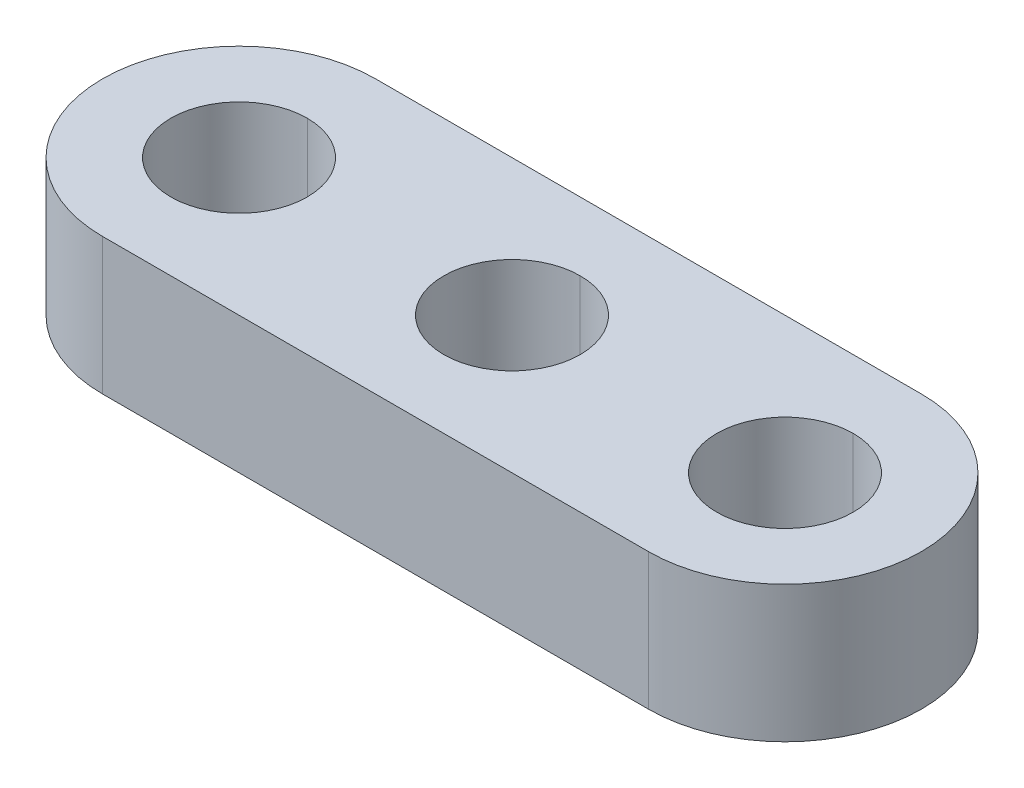
ISO-10303-21;
HEADER;
FILE_DESCRIPTION(('STEP AP214'),'2;1');
FILE_NAME('part.step','',(''),(''),'','','');
FILE_SCHEMA(('AUTOMOTIVE_DESIGN { 1 0 10303 214 1 1 1 1 }'));
ENDSEC;
DATA;
#1=APPLICATION_CONTEXT('core data for automotive mechanical design processes');
#2=APPLICATION_PROTOCOL_DEFINITION('international standard','automotive_design',2000,#1);
#3=PRODUCT_CONTEXT('',#1,'mechanical');
#4=PRODUCT('Part','Part','',(#3));
#5=PRODUCT_RELATED_PRODUCT_CATEGORY('part','',(#4));
#6=PRODUCT_DEFINITION_FORMATION('','',#4);
#7=PRODUCT_DEFINITION_CONTEXT('part definition',#1,'design');
#8=PRODUCT_DEFINITION('design','',#6,#7);
#9=PRODUCT_DEFINITION_SHAPE('','',#8);
#10=(LENGTH_UNIT() NAMED_UNIT(*) SI_UNIT(.MILLI.,.METRE.));
#11=(NAMED_UNIT(*) PLANE_ANGLE_UNIT() SI_UNIT($,.RADIAN.));
#12=(NAMED_UNIT(*) SI_UNIT($,.STERADIAN.) SOLID_ANGLE_UNIT());
#13=UNCERTAINTY_MEASURE_WITH_UNIT(LENGTH_MEASURE(1.E-05),#10,'distance_accuracy_value','');
#14=(GEOMETRIC_REPRESENTATION_CONTEXT(3) GLOBAL_UNCERTAINTY_ASSIGNED_CONTEXT((#13)) GLOBAL_UNIT_ASSIGNED_CONTEXT((#10,
#11,#12)) REPRESENTATION_CONTEXT('',''));
#15=CARTESIAN_POINT('',(0.,0.,0.));
#16=DIRECTION('',(0.,0.,1.));
#17=DIRECTION('',(1.,0.,0.));
#18=AXIS2_PLACEMENT_3D('',#15,#16,#17);
#19=CARTESIAN_POINT('',(8.,4.,0.));
#20=DIRECTION('',(0.,1.,0.));
#21=DIRECTION('',(0.,0.,1.));
#22=AXIS2_PLACEMENT_3D('',#19,#20,#21);
#23=CYLINDRICAL_SURFACE('',#22,2.);
#24=DIRECTION('',(0.,1.,0.));
#25=VECTOR('',#24,1.);
#26=CARTESIAN_POINT('',(8.,4.,-2.));
#27=LINE('',#26,#25);
#28=CARTESIAN_POINT('',(8.,0.,-2.));
#29=VERTEX_POINT('',#28);
#30=CARTESIAN_POINT('',(8.,4.,-2.));
#31=VERTEX_POINT('',#30);
#32=EDGE_CURVE('E17',#29,#31,#27,.T.);
#33=ORIENTED_EDGE('',*,*,#32,.F.);
#34=CARTESIAN_POINT('',(8.,0.,0.));
#35=DIRECTION('',(0.,1.,0.));
#36=DIRECTION('',(0.,0.,1.));
#37=AXIS2_PLACEMENT_3D('',#34,#35,#36);
#38=CIRCLE('',#37,2.);
#39=CARTESIAN_POINT('',(8.,0.,2.));
#40=VERTEX_POINT('',#39);
#41=EDGE_CURVE('E180',#40,#29,#38,.T.);
#42=ORIENTED_EDGE('',*,*,#41,.F.);
#43=DIRECTION('',(0.,1.,0.));
#44=VECTOR('',#43,1.);
#45=CARTESIAN_POINT('',(8.,4.,2.));
#46=LINE('',#45,#44);
#47=CARTESIAN_POINT('',(8.,4.,2.));
#48=VERTEX_POINT('',#47);
#49=EDGE_CURVE('E182',#40,#48,#46,.T.);
#50=ORIENTED_EDGE('',*,*,#49,.T.);
#51=CARTESIAN_POINT('',(8.,4.,0.));
#52=DIRECTION('',(0.,1.,0.));
#53=DIRECTION('',(0.,0.,1.));
#54=AXIS2_PLACEMENT_3D('',#51,#52,#53);
#55=CIRCLE('',#54,2.);
#56=EDGE_CURVE('E106',#48,#31,#55,.T.);
#57=ORIENTED_EDGE('',*,*,#56,.T.);
#58=EDGE_LOOP('',(#33,#42,#50,#57));
#59=FACE_BOUND('',#58,.T.);
#60=ADVANCED_FACE('F14',(#59),#23,.F.);
#61=CARTESIAN_POINT('',(0.,4.,0.));
#62=DIRECTION('',(0.,1.,0.));
#63=DIRECTION('',(0.,0.,1.));
#64=AXIS2_PLACEMENT_3D('',#61,#62,#63);
#65=CYLINDRICAL_SURFACE('',#64,2.);
#66=DIRECTION('',(0.,1.,0.));
#67=VECTOR('',#66,1.);
#68=CARTESIAN_POINT('',(0.,4.,-2.));
#69=LINE('',#68,#67);
#70=CARTESIAN_POINT('',(0.,0.,-2.));
#71=VERTEX_POINT('',#70);
#72=CARTESIAN_POINT('',(0.,4.,-2.));
#73=VERTEX_POINT('',#72);
#74=EDGE_CURVE('E118',#71,#73,#69,.T.);
#75=ORIENTED_EDGE('',*,*,#74,.F.);
#76=CARTESIAN_POINT('',(0.,0.,0.));
#77=DIRECTION('',(0.,1.,0.));
#78=DIRECTION('',(0.,0.,1.));
#79=AXIS2_PLACEMENT_3D('',#76,#77,#78);
#80=CIRCLE('',#79,2.);
#81=CARTESIAN_POINT('',(0.,0.,2.));
#82=VERTEX_POINT('',#81);
#83=EDGE_CURVE('E24',#82,#71,#80,.T.);
#84=ORIENTED_EDGE('',*,*,#83,.F.);
#85=DIRECTION('',(0.,1.,0.));
#86=VECTOR('',#85,1.);
#87=CARTESIAN_POINT('',(0.,4.,2.));
#88=LINE('',#87,#86);
#89=CARTESIAN_POINT('',(0.,4.,2.));
#90=VERTEX_POINT('',#89);
#91=EDGE_CURVE('E109',#82,#90,#88,.T.);
#92=ORIENTED_EDGE('',*,*,#91,.T.);
#93=CARTESIAN_POINT('',(0.,4.,0.));
#94=DIRECTION('',(0.,1.,0.));
#95=DIRECTION('',(0.,0.,1.));
#96=AXIS2_PLACEMENT_3D('',#93,#94,#95);
#97=CIRCLE('',#96,2.);
#98=EDGE_CURVE('E95',#90,#73,#97,.T.);
#99=ORIENTED_EDGE('',*,*,#98,.T.);
#100=EDGE_LOOP('',(#75,#84,#92,#99));
#101=FACE_BOUND('',#100,.T.);
#102=ADVANCED_FACE('F110',(#101),#65,.F.);
#103=CARTESIAN_POINT('',(-8.,4.,0.));
#104=DIRECTION('',(0.,1.,0.));
#105=DIRECTION('',(0.,0.,1.));
#106=AXIS2_PLACEMENT_3D('',#103,#104,#105);
#107=CYLINDRICAL_SURFACE('',#106,2.);
#108=DIRECTION('',(0.,1.,0.));
#109=VECTOR('',#108,1.);
#110=CARTESIAN_POINT('',(-8.,4.,-2.));
#111=LINE('',#110,#109);
#112=CARTESIAN_POINT('',(-8.,0.,-2.));
#113=VERTEX_POINT('',#112);
#114=CARTESIAN_POINT('',(-8.,4.,-2.));
#115=VERTEX_POINT('',#114);
#116=EDGE_CURVE('E140',#113,#115,#111,.T.);
#117=ORIENTED_EDGE('',*,*,#116,.F.);
#118=CARTESIAN_POINT('',(-8.,0.,0.));
#119=DIRECTION('',(0.,1.,0.));
#120=DIRECTION('',(0.,0.,1.));
#121=AXIS2_PLACEMENT_3D('',#118,#119,#120);
#122=CIRCLE('',#121,2.);
#123=CARTESIAN_POINT('',(-8.,0.,2.));
#124=VERTEX_POINT('',#123);
#125=EDGE_CURVE('E9',#124,#113,#122,.T.);
#126=ORIENTED_EDGE('',*,*,#125,.F.);
#127=DIRECTION('',(0.,1.,0.));
#128=VECTOR('',#127,1.);
#129=CARTESIAN_POINT('',(-8.,4.,2.));
#130=LINE('',#129,#128);
#131=CARTESIAN_POINT('',(-8.,4.,2.));
#132=VERTEX_POINT('',#131);
#133=EDGE_CURVE('E129',#124,#132,#130,.T.);
#134=ORIENTED_EDGE('',*,*,#133,.T.);
#135=CARTESIAN_POINT('',(-8.,4.,0.));
#136=DIRECTION('',(0.,1.,0.));
#137=DIRECTION('',(0.,0.,1.));
#138=AXIS2_PLACEMENT_3D('',#135,#136,#137);
#139=CIRCLE('',#138,2.);
#140=EDGE_CURVE('E105',#132,#115,#139,.T.);
#141=ORIENTED_EDGE('',*,*,#140,.T.);
#142=EDGE_LOOP('',(#117,#126,#134,#141));
#143=FACE_BOUND('',#142,.T.);
#144=ADVANCED_FACE('F263',(#143),#107,.F.);
#145=CARTESIAN_POINT('',(-8.,0.,0.));
#146=DIRECTION('',(0.,1.,0.));
#147=DIRECTION('',(1.,0.,0.));
#148=AXIS2_PLACEMENT_3D('',#145,#146,#147);
#149=PLANE('',#148);
#150=ORIENTED_EDGE('',*,*,#125,.T.);
#151=CARTESIAN_POINT('',(-8.,0.,0.));
#152=DIRECTION('',(0.,1.,0.));
#153=DIRECTION('',(0.,0.,1.));
#154=AXIS2_PLACEMENT_3D('',#151,#152,#153);
#155=CIRCLE('',#154,2.);
#156=EDGE_CURVE('E115',#113,#124,#155,.T.);
#157=ORIENTED_EDGE('',*,*,#156,.T.);
#158=EDGE_LOOP('',(#150,#157));
#159=FACE_BOUND('',#158,.T.);
#160=ORIENTED_EDGE('',*,*,#83,.T.);
#161=CARTESIAN_POINT('',(0.,0.,0.));
#162=DIRECTION('',(0.,1.,0.));
#163=DIRECTION('',(0.,0.,1.));
#164=AXIS2_PLACEMENT_3D('',#161,#162,#163);
#165=CIRCLE('',#164,2.);
#166=EDGE_CURVE('E125',#71,#82,#165,.T.);
#167=ORIENTED_EDGE('',*,*,#166,.T.);
#168=EDGE_LOOP('',(#160,#167));
#169=FACE_BOUND('',#168,.T.);
#170=ORIENTED_EDGE('',*,*,#41,.T.);
#171=CARTESIAN_POINT('',(8.,0.,0.));
#172=DIRECTION('',(0.,1.,0.));
#173=DIRECTION('',(0.,0.,1.));
#174=AXIS2_PLACEMENT_3D('',#171,#172,#173);
#175=CIRCLE('',#174,2.);
#176=EDGE_CURVE('E218',#29,#40,#175,.T.);
#177=ORIENTED_EDGE('',*,*,#176,.T.);
#178=EDGE_LOOP('',(#170,#177));
#179=FACE_BOUND('',#178,.T.);
#180=CARTESIAN_POINT('',(-8.,0.,0.));
#181=DIRECTION('',(0.,1.,0.));
#182=DIRECTION('',(0.,0.,1.));
#183=AXIS2_PLACEMENT_3D('',#180,#181,#182);
#184=CIRCLE('',#183,4.);
#185=CARTESIAN_POINT('',(-8.,0.,-4.));
#186=VERTEX_POINT('',#185);
#187=CARTESIAN_POINT('',(-8.,0.,4.));
#188=VERTEX_POINT('',#187);
#189=EDGE_CURVE('E131',#186,#188,#184,.T.);
#190=ORIENTED_EDGE('',*,*,#189,.F.);
#191=DIRECTION('',(-1.,0.,0.));
#192=VECTOR('',#191,1.);
#193=CARTESIAN_POINT('',(-8.,0.,-4.));
#194=LINE('',#193,#192);
#195=CARTESIAN_POINT('',(8.,0.,-4.));
#196=VERTEX_POINT('',#195);
#197=EDGE_CURVE('E158',#196,#186,#194,.T.);
#198=ORIENTED_EDGE('',*,*,#197,.F.);
#199=CARTESIAN_POINT('',(8.,0.,0.));
#200=DIRECTION('',(0.,1.,0.));
#201=DIRECTION('',(0.,0.,1.));
#202=AXIS2_PLACEMENT_3D('',#199,#200,#201);
#203=CIRCLE('',#202,4.);
#204=CARTESIAN_POINT('',(8.,0.,4.));
#205=VERTEX_POINT('',#204);
#206=EDGE_CURVE('E150',#205,#196,#203,.T.);
#207=ORIENTED_EDGE('',*,*,#206,.F.);
#208=DIRECTION('',(1.,0.,0.));
#209=VECTOR('',#208,1.);
#210=CARTESIAN_POINT('',(-8.,0.,4.));
#211=LINE('',#210,#209);
#212=EDGE_CURVE('E137',#188,#205,#211,.T.);
#213=ORIENTED_EDGE('',*,*,#212,.F.);
#214=EDGE_LOOP('',(#190,#198,#207,#213));
#215=FACE_BOUND('',#214,.T.);
#216=ADVANCED_FACE('F236',(#159,#169,#179,#215),#149,.F.);
#217=CARTESIAN_POINT('',(-8.,4.,0.));
#218=DIRECTION('',(0.,1.,0.));
#219=DIRECTION('',(1.,0.,0.));
#220=AXIS2_PLACEMENT_3D('',#217,#218,#219);
#221=PLANE('',#220);
#222=ORIENTED_EDGE('',*,*,#140,.F.);
#223=CARTESIAN_POINT('',(-8.,4.,0.));
#224=DIRECTION('',(0.,1.,0.));
#225=DIRECTION('',(0.,0.,1.));
#226=AXIS2_PLACEMENT_3D('',#223,#224,#225);
#227=CIRCLE('',#226,2.);
#228=EDGE_CURVE('E132',#115,#132,#227,.T.);
#229=ORIENTED_EDGE('',*,*,#228,.F.);
#230=EDGE_LOOP('',(#222,#229));
#231=FACE_BOUND('',#230,.T.);
#232=ORIENTED_EDGE('',*,*,#98,.F.);
#233=CARTESIAN_POINT('',(0.,4.,0.));
#234=DIRECTION('',(0.,1.,0.));
#235=DIRECTION('',(0.,0.,1.));
#236=AXIS2_PLACEMENT_3D('',#233,#234,#235);
#237=CIRCLE('',#236,2.);
#238=EDGE_CURVE('E100',#73,#90,#237,.T.);
#239=ORIENTED_EDGE('',*,*,#238,.F.);
#240=EDGE_LOOP('',(#232,#239));
#241=FACE_BOUND('',#240,.T.);
#242=ORIENTED_EDGE('',*,*,#56,.F.);
#243=CARTESIAN_POINT('',(8.,4.,0.));
#244=DIRECTION('',(0.,1.,0.));
#245=DIRECTION('',(0.,0.,1.));
#246=AXIS2_PLACEMENT_3D('',#243,#244,#245);
#247=CIRCLE('',#246,2.);
#248=EDGE_CURVE('E193',#31,#48,#247,.T.);
#249=ORIENTED_EDGE('',*,*,#248,.F.);
#250=EDGE_LOOP('',(#242,#249));
#251=FACE_BOUND('',#250,.T.);
#252=CARTESIAN_POINT('',(-8.,4.,0.));
#253=DIRECTION('',(0.,1.,0.));
#254=DIRECTION('',(0.,0.,1.));
#255=AXIS2_PLACEMENT_3D('',#252,#253,#254);
#256=CIRCLE('',#255,4.);
#257=CARTESIAN_POINT('',(-8.,4.,-4.));
#258=VERTEX_POINT('',#257);
#259=CARTESIAN_POINT('',(-8.,4.,4.));
#260=VERTEX_POINT('',#259);
#261=EDGE_CURVE('E138',#258,#260,#256,.T.);
#262=ORIENTED_EDGE('',*,*,#261,.T.);
#263=DIRECTION('',(1.,0.,0.));
#264=VECTOR('',#263,1.);
#265=CARTESIAN_POINT('',(-8.,4.,4.));
#266=LINE('',#265,#264);
#267=CARTESIAN_POINT('',(8.,4.,4.));
#268=VERTEX_POINT('',#267);
#269=EDGE_CURVE('E161',#260,#268,#266,.T.);
#270=ORIENTED_EDGE('',*,*,#269,.T.);
#271=CARTESIAN_POINT('',(8.,4.,0.));
#272=DIRECTION('',(0.,1.,0.));
#273=DIRECTION('',(0.,0.,1.));
#274=AXIS2_PLACEMENT_3D('',#271,#272,#273);
#275=CIRCLE('',#274,4.);
#276=CARTESIAN_POINT('',(8.,4.,-4.));
#277=VERTEX_POINT('',#276);
#278=EDGE_CURVE('E149',#268,#277,#275,.T.);
#279=ORIENTED_EDGE('',*,*,#278,.T.);
#280=DIRECTION('',(-1.,0.,0.));
#281=VECTOR('',#280,1.);
#282=CARTESIAN_POINT('',(-8.,4.,-4.));
#283=LINE('',#282,#281);
#284=EDGE_CURVE('E39',#277,#258,#283,.T.);
#285=ORIENTED_EDGE('',*,*,#284,.T.);
#286=EDGE_LOOP('',(#262,#270,#279,#285));
#287=FACE_BOUND('',#286,.T.);
#288=ADVANCED_FACE('F97',(#231,#241,#251,#287),#221,.T.);
#289=CARTESIAN_POINT('',(-8.,4.,-4.));
#290=DIRECTION('',(0.,0.,1.));
#291=DIRECTION('',(1.,0.,0.));
#292=AXIS2_PLACEMENT_3D('',#289,#290,#291);
#293=PLANE('',#292);
#294=ORIENTED_EDGE('',*,*,#197,.T.);
#295=DIRECTION('',(0.,-1.,0.));
#296=VECTOR('',#295,1.);
#297=CARTESIAN_POINT('',(-8.,4.,-4.));
#298=LINE('',#297,#296);
#299=EDGE_CURVE('E134',#258,#186,#298,.T.);
#300=ORIENTED_EDGE('',*,*,#299,.F.);
#301=ORIENTED_EDGE('',*,*,#284,.F.);
#302=DIRECTION('',(0.,-1.,0.));
#303=VECTOR('',#302,1.);
#304=CARTESIAN_POINT('',(8.,4.,-4.));
#305=LINE('',#304,#303);
#306=EDGE_CURVE('E147',#277,#196,#305,.T.);
#307=ORIENTED_EDGE('',*,*,#306,.T.);
#308=EDGE_LOOP('',(#294,#300,#301,#307));
#309=FACE_BOUND('',#308,.T.);
#310=ADVANCED_FACE('F271',(#309),#293,.F.);
#311=CARTESIAN_POINT('',(8.,4.,0.));
#312=DIRECTION('',(0.,-1.,0.));
#313=DIRECTION('',(0.,0.,-1.));
#314=AXIS2_PLACEMENT_3D('',#311,#312,#313);
#315=CYLINDRICAL_SURFACE('',#314,4.);
#316=ORIENTED_EDGE('',*,*,#206,.T.);
#317=ORIENTED_EDGE('',*,*,#306,.F.);
#318=ORIENTED_EDGE('',*,*,#278,.F.);
#319=DIRECTION('',(0.,-1.,0.));
#320=VECTOR('',#319,1.);
#321=CARTESIAN_POINT('',(8.,4.,4.));
#322=LINE('',#321,#320);
#323=EDGE_CURVE('E171',#268,#205,#322,.T.);
#324=ORIENTED_EDGE('',*,*,#323,.T.);
#325=EDGE_LOOP('',(#316,#317,#318,#324));
#326=FACE_BOUND('',#325,.T.);
#327=ADVANCED_FACE('F227',(#326),#315,.T.);
#328=CARTESIAN_POINT('',(-8.,4.,4.));
#329=DIRECTION('',(0.,0.,-1.));
#330=DIRECTION('',(0.,-1.,0.));
#331=AXIS2_PLACEMENT_3D('',#328,#329,#330);
#332=PLANE('',#331);
#333=ORIENTED_EDGE('',*,*,#212,.T.);
#334=ORIENTED_EDGE('',*,*,#323,.F.);
#335=ORIENTED_EDGE('',*,*,#269,.F.);
#336=DIRECTION('',(0.,-1.,0.));
#337=VECTOR('',#336,1.);
#338=CARTESIAN_POINT('',(-8.,4.,4.));
#339=LINE('',#338,#337);
#340=EDGE_CURVE('E146',#260,#188,#339,.T.);
#341=ORIENTED_EDGE('',*,*,#340,.T.);
#342=EDGE_LOOP('',(#333,#334,#335,#341));
#343=FACE_BOUND('',#342,.T.);
#344=ADVANCED_FACE('F232',(#343),#332,.F.);
#345=CARTESIAN_POINT('',(-8.,4.,0.));
#346=DIRECTION('',(0.,-1.,0.));
#347=DIRECTION('',(0.,0.,-1.));
#348=AXIS2_PLACEMENT_3D('',#345,#346,#347);
#349=CYLINDRICAL_SURFACE('',#348,4.);
#350=ORIENTED_EDGE('',*,*,#189,.T.);
#351=ORIENTED_EDGE('',*,*,#340,.F.);
#352=ORIENTED_EDGE('',*,*,#261,.F.);
#353=ORIENTED_EDGE('',*,*,#299,.T.);
#354=EDGE_LOOP('',(#350,#351,#352,#353));
#355=FACE_BOUND('',#354,.T.);
#356=ADVANCED_FACE('F287',(#355),#349,.T.);
#357=CARTESIAN_POINT('',(-8.,4.,0.));
#358=DIRECTION('',(0.,1.,0.));
#359=DIRECTION('',(0.,0.,1.));
#360=AXIS2_PLACEMENT_3D('',#357,#358,#359);
#361=CYLINDRICAL_SURFACE('',#360,2.);
#362=ORIENTED_EDGE('',*,*,#156,.F.);
#363=ORIENTED_EDGE('',*,*,#116,.T.);
#364=ORIENTED_EDGE('',*,*,#228,.T.);
#365=ORIENTED_EDGE('',*,*,#133,.F.);
#366=EDGE_LOOP('',(#362,#363,#364,#365));
#367=FACE_BOUND('',#366,.T.);
#368=ADVANCED_FACE('F285',(#367),#361,.F.);
#369=CARTESIAN_POINT('',(0.,4.,0.));
#370=DIRECTION('',(0.,1.,0.));
#371=DIRECTION('',(0.,0.,1.));
#372=AXIS2_PLACEMENT_3D('',#369,#370,#371);
#373=CYLINDRICAL_SURFACE('',#372,2.);
#374=ORIENTED_EDGE('',*,*,#166,.F.);
#375=ORIENTED_EDGE('',*,*,#74,.T.);
#376=ORIENTED_EDGE('',*,*,#238,.T.);
#377=ORIENTED_EDGE('',*,*,#91,.F.);
#378=EDGE_LOOP('',(#374,#375,#376,#377));
#379=FACE_BOUND('',#378,.T.);
#380=ADVANCED_FACE('F117',(#379),#373,.F.);
#381=CARTESIAN_POINT('',(8.,4.,0.));
#382=DIRECTION('',(0.,1.,0.));
#383=DIRECTION('',(0.,0.,1.));
#384=AXIS2_PLACEMENT_3D('',#381,#382,#383);
#385=CYLINDRICAL_SURFACE('',#384,2.);
#386=ORIENTED_EDGE('',*,*,#176,.F.);
#387=ORIENTED_EDGE('',*,*,#32,.T.);
#388=ORIENTED_EDGE('',*,*,#248,.T.);
#389=ORIENTED_EDGE('',*,*,#49,.F.);
#390=EDGE_LOOP('',(#386,#387,#388,#389));
#391=FACE_BOUND('',#390,.T.);
#392=ADVANCED_FACE('F260',(#391),#385,.F.);
#393=CLOSED_SHELL('',(#60,#102,#144,#216,#288,#310,#327,#344,#356,#368,#380,#392));
#394=MANIFOLD_SOLID_BREP('B1',#393);
#395=ADVANCED_BREP_SHAPE_REPRESENTATION('',(#18,#394),#14);
#396=SHAPE_DEFINITION_REPRESENTATION(#9,#395);
ENDSEC;
END-ISO-10303-21;
